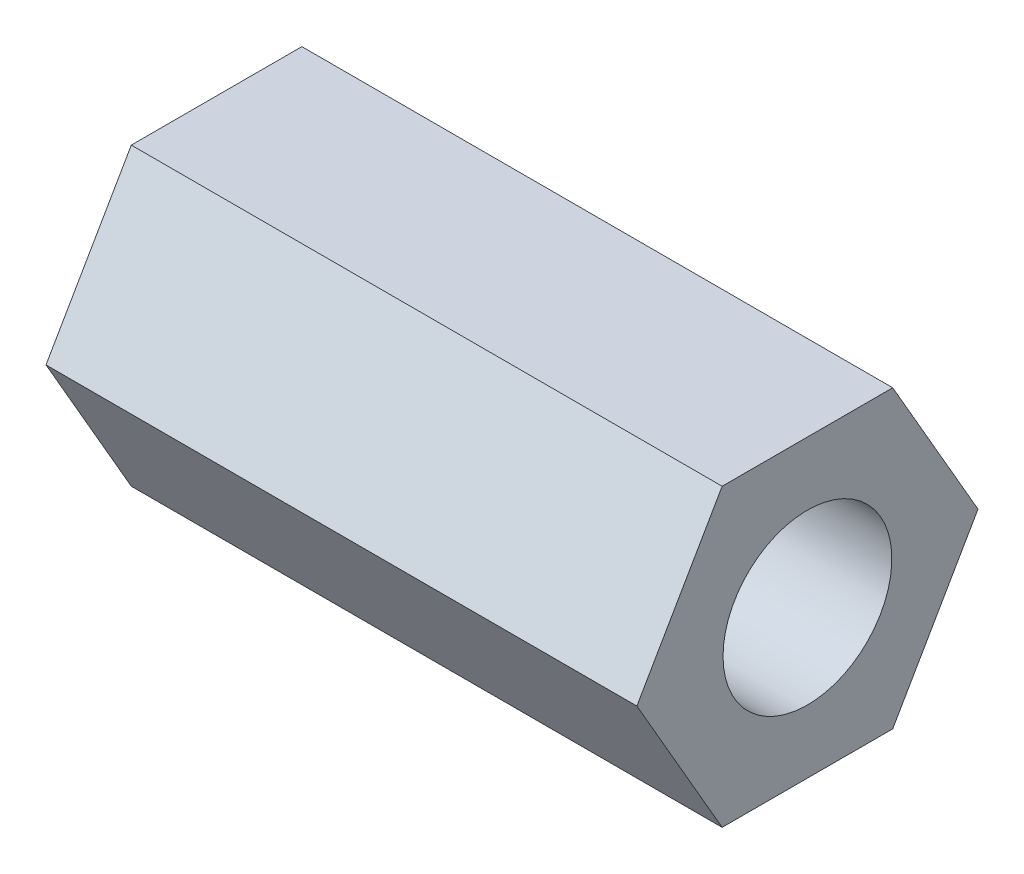
ISO-10303-21;
HEADER;
FILE_DESCRIPTION(('STEP AP214'),'2;1');
FILE_NAME('part.step','',(''),(''),'','','');
FILE_SCHEMA(('AUTOMOTIVE_DESIGN { 1 0 10303 214 1 1 1 1 }'));
ENDSEC;
DATA;
#1=APPLICATION_CONTEXT('core data for automotive mechanical design processes');
#2=APPLICATION_PROTOCOL_DEFINITION('international standard','automotive_design',2000,#1);
#3=PRODUCT_CONTEXT('',#1,'mechanical');
#4=PRODUCT('Part','Part','',(#3));
#5=PRODUCT_RELATED_PRODUCT_CATEGORY('part','',(#4));
#6=PRODUCT_DEFINITION_FORMATION('','',#4);
#7=PRODUCT_DEFINITION_CONTEXT('part definition',#1,'design');
#8=PRODUCT_DEFINITION('design','',#6,#7);
#9=PRODUCT_DEFINITION_SHAPE('','',#8);
#10=(LENGTH_UNIT() NAMED_UNIT(*) SI_UNIT(.MILLI.,.METRE.));
#11=(NAMED_UNIT(*) PLANE_ANGLE_UNIT() SI_UNIT($,.RADIAN.));
#12=(NAMED_UNIT(*) SI_UNIT($,.STERADIAN.) SOLID_ANGLE_UNIT());
#13=UNCERTAINTY_MEASURE_WITH_UNIT(LENGTH_MEASURE(1.E-05),#10,'distance_accuracy_value','');
#14=(GEOMETRIC_REPRESENTATION_CONTEXT(3) GLOBAL_UNCERTAINTY_ASSIGNED_CONTEXT((#13)) GLOBAL_UNIT_ASSIGNED_CONTEXT((#10,
#11,#12)) REPRESENTATION_CONTEXT('',''));
#15=CARTESIAN_POINT('',(0.,0.,0.));
#16=DIRECTION('',(0.,0.,1.));
#17=DIRECTION('',(1.,0.,0.));
#18=AXIS2_PLACEMENT_3D('',#15,#16,#17);
#19=CARTESIAN_POINT('',(22.225,-2.778125,4.81185364977729));
#20=DIRECTION('',(0.,0.499999999999999,-0.866025403784439));
#21=DIRECTION('',(0.,0.866025403784439,0.499999999999999));
#22=AXIS2_PLACEMENT_3D('',#19,#20,#21);
#23=PLANE('',#22);
#24=DIRECTION('',(0.,-0.866025403784439,-0.499999999999999));
#25=VECTOR('',#24,1.);
#26=CARTESIAN_POINT('',(0.,-2.778125,4.81185364977729));
#27=LINE('',#26,#25);
#28=CARTESIAN_POINT('',(0.,0.,6.41580486636972));
#29=VERTEX_POINT('',#28);
#30=CARTESIAN_POINT('',(0.,-5.55625,3.20790243318486));
#31=VERTEX_POINT('',#30);
#32=EDGE_CURVE('E123',#29,#31,#27,.T.);
#33=ORIENTED_EDGE('',*,*,#32,.T.);
#34=DIRECTION('',(-1.,0.,0.));
#35=VECTOR('',#34,1.);
#36=CARTESIAN_POINT('',(22.225,-5.55625,3.20790243318486));
#37=LINE('',#36,#35);
#38=CARTESIAN_POINT('',(22.225,-5.55625,3.20790243318486));
#39=VERTEX_POINT('',#38);
#40=EDGE_CURVE('E11',#39,#31,#37,.T.);
#41=ORIENTED_EDGE('',*,*,#40,.F.);
#42=DIRECTION('',(0.,-0.866025403784439,-0.499999999999999));
#43=VECTOR('',#42,1.);
#44=CARTESIAN_POINT('',(22.225,-2.778125,4.81185364977729));
#45=LINE('',#44,#43);
#46=CARTESIAN_POINT('',(22.225,0.,6.41580486636972));
#47=VERTEX_POINT('',#46);
#48=EDGE_CURVE('E134',#47,#39,#45,.T.);
#49=ORIENTED_EDGE('',*,*,#48,.F.);
#50=DIRECTION('',(-1.,0.,0.));
#51=VECTOR('',#50,1.);
#52=CARTESIAN_POINT('',(22.225,0.,6.41580486636972));
#53=LINE('',#52,#51);
#54=EDGE_CURVE('E119',#47,#29,#53,.T.);
#55=ORIENTED_EDGE('',*,*,#54,.T.);
#56=EDGE_LOOP('',(#33,#41,#49,#55));
#57=FACE_BOUND('',#56,.T.);
#58=ADVANCED_FACE('F39',(#57),#23,.F.);
#59=CARTESIAN_POINT('',(22.225,-5.55625,0.));
#60=DIRECTION('',(0.,1.,0.));
#61=DIRECTION('',(0.,0.,1.));
#62=AXIS2_PLACEMENT_3D('',#59,#60,#61);
#63=PLANE('',#62);
#64=DIRECTION('',(0.,0.,-1.));
#65=VECTOR('',#64,1.);
#66=CARTESIAN_POINT('',(0.,-5.55625,0.));
#67=LINE('',#66,#65);
#68=CARTESIAN_POINT('',(0.,-5.55625,-3.20790243318485));
#69=VERTEX_POINT('',#68);
#70=EDGE_CURVE('E126',#31,#69,#67,.T.);
#71=ORIENTED_EDGE('',*,*,#70,.T.);
#72=DIRECTION('',(-1.,0.,0.));
#73=VECTOR('',#72,1.);
#74=CARTESIAN_POINT('',(22.225,-5.55625,-3.20790243318485));
#75=LINE('',#74,#73);
#76=CARTESIAN_POINT('',(22.225,-5.55625,-3.20790243318485));
#77=VERTEX_POINT('',#76);
#78=EDGE_CURVE('E47',#77,#69,#75,.T.);
#79=ORIENTED_EDGE('',*,*,#78,.F.);
#80=DIRECTION('',(0.,0.,-1.));
#81=VECTOR('',#80,1.);
#82=CARTESIAN_POINT('',(22.225,-5.55625,0.));
#83=LINE('',#82,#81);
#84=EDGE_CURVE('E92',#39,#77,#83,.T.);
#85=ORIENTED_EDGE('',*,*,#84,.F.);
#86=ORIENTED_EDGE('',*,*,#40,.T.);
#87=EDGE_LOOP('',(#71,#79,#85,#86));
#88=FACE_BOUND('',#87,.T.);
#89=ADVANCED_FACE('F159',(#88),#63,.F.);
#90=CARTESIAN_POINT('',(22.225,-2.778125,-4.81185364977728));
#91=DIRECTION('',(0.,0.5,0.866025403784439));
#92=DIRECTION('',(0.,-0.866025403784439,0.5));
#93=AXIS2_PLACEMENT_3D('',#90,#91,#92);
#94=PLANE('',#93);
#95=DIRECTION('',(0.,0.866025403784439,-0.5));
#96=VECTOR('',#95,1.);
#97=CARTESIAN_POINT('',(0.,-2.778125,-4.81185364977728));
#98=LINE('',#97,#96);
#99=CARTESIAN_POINT('',(0.,0.,-6.41580486636971));
#100=VERTEX_POINT('',#99);
#101=EDGE_CURVE('E129',#69,#100,#98,.T.);
#102=ORIENTED_EDGE('',*,*,#101,.T.);
#103=DIRECTION('',(-1.,0.,0.));
#104=VECTOR('',#103,1.);
#105=CARTESIAN_POINT('',(22.225,0.,-6.41580486636971));
#106=LINE('',#105,#104);
#107=CARTESIAN_POINT('',(22.225,0.,-6.41580486636971));
#108=VERTEX_POINT('',#107);
#109=EDGE_CURVE('E114',#108,#100,#106,.T.);
#110=ORIENTED_EDGE('',*,*,#109,.F.);
#111=DIRECTION('',(0.,0.866025403784439,-0.5));
#112=VECTOR('',#111,1.);
#113=CARTESIAN_POINT('',(22.225,-2.778125,-4.81185364977728));
#114=LINE('',#113,#112);
#115=EDGE_CURVE('E105',#77,#108,#114,.T.);
#116=ORIENTED_EDGE('',*,*,#115,.F.);
#117=ORIENTED_EDGE('',*,*,#78,.T.);
#118=EDGE_LOOP('',(#102,#110,#116,#117));
#119=FACE_BOUND('',#118,.T.);
#120=ADVANCED_FACE('F140',(#119),#94,.F.);
#121=CARTESIAN_POINT('',(22.225,2.778125,-4.81185364977728));
#122=DIRECTION('',(0.,-0.5,0.866025403784438));
#123=DIRECTION('',(0.,-0.866025403784439,-0.5));
#124=AXIS2_PLACEMENT_3D('',#121,#122,#123);
#125=PLANE('',#124);
#126=DIRECTION('',(0.,0.866025403784439,0.5));
#127=VECTOR('',#126,1.);
#128=CARTESIAN_POINT('',(0.,2.778125,-4.81185364977728));
#129=LINE('',#128,#127);
#130=CARTESIAN_POINT('',(0.,5.55625,-3.20790243318485));
#131=VERTEX_POINT('',#130);
#132=EDGE_CURVE('E113',#100,#131,#129,.T.);
#133=ORIENTED_EDGE('',*,*,#132,.T.);
#134=DIRECTION('',(-1.,0.,0.));
#135=VECTOR('',#134,1.);
#136=CARTESIAN_POINT('',(22.225,5.55625,-3.20790243318485));
#137=LINE('',#136,#135);
#138=CARTESIAN_POINT('',(22.225,5.55625,-3.20790243318485));
#139=VERTEX_POINT('',#138);
#140=EDGE_CURVE('E110',#139,#131,#137,.T.);
#141=ORIENTED_EDGE('',*,*,#140,.F.);
#142=DIRECTION('',(0.,0.866025403784439,0.5));
#143=VECTOR('',#142,1.);
#144=CARTESIAN_POINT('',(22.225,2.778125,-4.81185364977728));
#145=LINE('',#144,#143);
#146=EDGE_CURVE('E99',#108,#139,#145,.T.);
#147=ORIENTED_EDGE('',*,*,#146,.F.);
#148=ORIENTED_EDGE('',*,*,#109,.T.);
#149=EDGE_LOOP('',(#133,#141,#147,#148));
#150=FACE_BOUND('',#149,.T.);
#151=ADVANCED_FACE('F111',(#150),#125,.F.);
#152=CARTESIAN_POINT('',(22.225,5.55625,0.));
#153=DIRECTION('',(0.,-1.,0.));
#154=DIRECTION('',(0.,0.,-1.));
#155=AXIS2_PLACEMENT_3D('',#152,#153,#154);
#156=PLANE('',#155);
#157=DIRECTION('',(0.,0.,1.));
#158=VECTOR('',#157,1.);
#159=CARTESIAN_POINT('',(0.,5.55625,0.));
#160=LINE('',#159,#158);
#161=CARTESIAN_POINT('',(0.,5.55625,3.20790243318486));
#162=VERTEX_POINT('',#161);
#163=EDGE_CURVE('E78',#131,#162,#160,.T.);
#164=ORIENTED_EDGE('',*,*,#163,.T.);
#165=DIRECTION('',(-1.,0.,0.));
#166=VECTOR('',#165,1.);
#167=CARTESIAN_POINT('',(22.225,5.55625,3.20790243318486));
#168=LINE('',#167,#166);
#169=CARTESIAN_POINT('',(22.225,5.55625,3.20790243318486));
#170=VERTEX_POINT('',#169);
#171=EDGE_CURVE('E115',#170,#162,#168,.T.);
#172=ORIENTED_EDGE('',*,*,#171,.F.);
#173=DIRECTION('',(0.,0.,1.));
#174=VECTOR('',#173,1.);
#175=CARTESIAN_POINT('',(22.225,5.55625,0.));
#176=LINE('',#175,#174);
#177=EDGE_CURVE('E103',#139,#170,#176,.T.);
#178=ORIENTED_EDGE('',*,*,#177,.F.);
#179=ORIENTED_EDGE('',*,*,#140,.T.);
#180=EDGE_LOOP('',(#164,#172,#178,#179));
#181=FACE_BOUND('',#180,.T.);
#182=ADVANCED_FACE('F117',(#181),#156,.F.);
#183=CARTESIAN_POINT('',(22.225,2.778125,4.81185364977729));
#184=DIRECTION('',(0.,-0.5,-0.866025403784439));
#185=DIRECTION('',(0.,0.866025403784439,-0.5));
#186=AXIS2_PLACEMENT_3D('',#183,#184,#185);
#187=PLANE('',#186);
#188=DIRECTION('',(0.,-0.866025403784439,0.5));
#189=VECTOR('',#188,1.);
#190=CARTESIAN_POINT('',(0.,2.778125,4.81185364977729));
#191=LINE('',#190,#189);
#192=EDGE_CURVE('E84',#162,#29,#191,.T.);
#193=ORIENTED_EDGE('',*,*,#192,.T.);
#194=ORIENTED_EDGE('',*,*,#54,.F.);
#195=DIRECTION('',(0.,-0.866025403784439,0.5));
#196=VECTOR('',#195,1.);
#197=CARTESIAN_POINT('',(22.225,2.778125,4.81185364977729));
#198=LINE('',#197,#196);
#199=EDGE_CURVE('E55',#170,#47,#198,.T.);
#200=ORIENTED_EDGE('',*,*,#199,.F.);
#201=ORIENTED_EDGE('',*,*,#171,.T.);
#202=EDGE_LOOP('',(#193,#194,#200,#201));
#203=FACE_BOUND('',#202,.T.);
#204=ADVANCED_FACE('F147',(#203),#187,.F.);
#205=CARTESIAN_POINT('',(22.225,0.,0.));
#206=DIRECTION('',(1.,0.,0.));
#207=DIRECTION('',(0.,0.,-1.));
#208=AXIS2_PLACEMENT_3D('',#205,#206,#207);
#209=PLANE('',#208);
#210=CARTESIAN_POINT('',(22.225,0.,0.));
#211=DIRECTION('',(-1.,0.,0.));
#212=DIRECTION('',(0.,0.,1.));
#213=AXIS2_PLACEMENT_3D('',#210,#211,#212);
#214=CIRCLE('',#213,3.175);
#215=CARTESIAN_POINT('',(22.225,0.,3.175));
#216=VERTEX_POINT('',#215);
#217=EDGE_CURVE('E127',#216,#216,#214,.T.);
#218=ORIENTED_EDGE('',*,*,#217,.T.);
#219=EDGE_LOOP('',(#218));
#220=FACE_BOUND('',#219,.T.);
#221=ORIENTED_EDGE('',*,*,#48,.T.);
#222=ORIENTED_EDGE('',*,*,#84,.T.);
#223=ORIENTED_EDGE('',*,*,#115,.T.);
#224=ORIENTED_EDGE('',*,*,#146,.T.);
#225=ORIENTED_EDGE('',*,*,#177,.T.);
#226=ORIENTED_EDGE('',*,*,#199,.T.);
#227=EDGE_LOOP('',(#221,#222,#223,#224,#225,#226));
#228=FACE_BOUND('',#227,.T.);
#229=ADVANCED_FACE('F101',(#220,#228),#209,.T.);
#230=CARTESIAN_POINT('',(0.,0.,0.));
#231=DIRECTION('',(1.,0.,0.));
#232=DIRECTION('',(0.,0.,-1.));
#233=AXIS2_PLACEMENT_3D('',#230,#231,#232);
#234=PLANE('',#233);
#235=CARTESIAN_POINT('',(0.,0.,0.));
#236=DIRECTION('',(-1.,0.,0.));
#237=DIRECTION('',(0.,0.,1.));
#238=AXIS2_PLACEMENT_3D('',#235,#236,#237);
#239=CIRCLE('',#238,3.175);
#240=CARTESIAN_POINT('',(0.,0.,3.175));
#241=VERTEX_POINT('',#240);
#242=EDGE_CURVE('E216',#241,#241,#239,.T.);
#243=ORIENTED_EDGE('',*,*,#242,.F.);
#244=EDGE_LOOP('',(#243));
#245=FACE_BOUND('',#244,.T.);
#246=ORIENTED_EDGE('',*,*,#32,.F.);
#247=ORIENTED_EDGE('',*,*,#192,.F.);
#248=ORIENTED_EDGE('',*,*,#163,.F.);
#249=ORIENTED_EDGE('',*,*,#132,.F.);
#250=ORIENTED_EDGE('',*,*,#101,.F.);
#251=ORIENTED_EDGE('',*,*,#70,.F.);
#252=EDGE_LOOP('',(#246,#247,#248,#249,#250,#251));
#253=FACE_BOUND('',#252,.T.);
#254=ADVANCED_FACE('F143',(#245,#253),#234,.F.);
#255=CARTESIAN_POINT('',(22.225,0.,0.));
#256=DIRECTION('',(-1.,0.,0.));
#257=DIRECTION('',(0.,0.,1.));
#258=AXIS2_PLACEMENT_3D('',#255,#256,#257);
#259=CYLINDRICAL_SURFACE('',#258,3.175);
#260=ORIENTED_EDGE('',*,*,#217,.F.);
#261=EDGE_LOOP('',(#260));
#262=FACE_BOUND('',#261,.T.);
#263=ORIENTED_EDGE('',*,*,#242,.T.);
#264=EDGE_LOOP('',(#263));
#265=FACE_BOUND('',#264,.T.);
#266=ADVANCED_FACE('F198',(#262,#265),#259,.F.);
#267=CLOSED_SHELL('',(#58,#89,#120,#151,#182,#204,#229,#254,#266));
#268=MANIFOLD_SOLID_BREP('B2',#267);
#269=ADVANCED_BREP_SHAPE_REPRESENTATION('',(#18,#268),#14);
#270=SHAPE_DEFINITION_REPRESENTATION(#9,#269);
ENDSEC;
END-ISO-10303-21;
